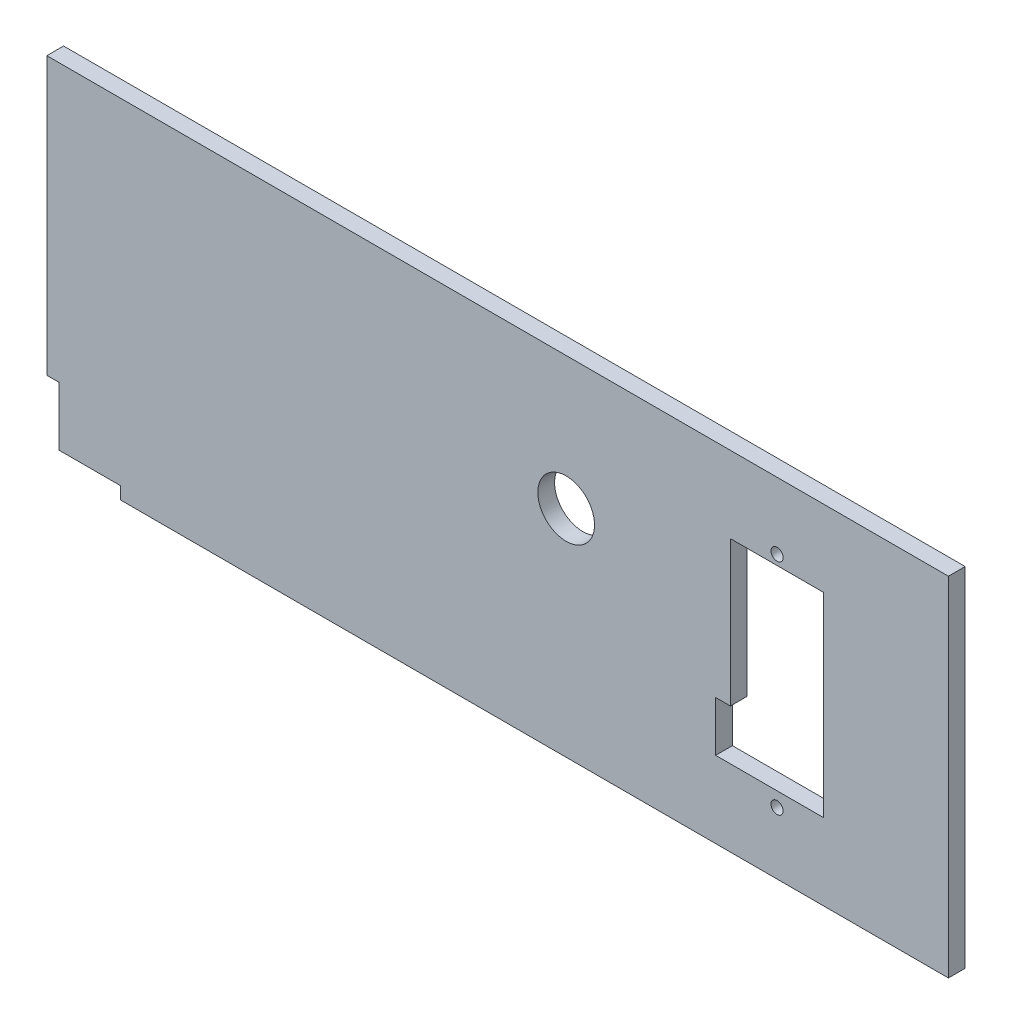
ISO-10303-21;
HEADER;
FILE_DESCRIPTION(('STEP AP214'),'2;1');
FILE_NAME('part.step','',(''),(''),'','','');
FILE_SCHEMA(('AUTOMOTIVE_DESIGN { 1 0 10303 214 1 1 1 1 }'));
ENDSEC;
DATA;
#1=APPLICATION_CONTEXT('core data for automotive mechanical design processes');
#2=APPLICATION_PROTOCOL_DEFINITION('international standard','automotive_design',2000,#1);
#3=PRODUCT_CONTEXT('',#1,'mechanical');
#4=PRODUCT('Part','Part','',(#3));
#5=PRODUCT_RELATED_PRODUCT_CATEGORY('part','',(#4));
#6=PRODUCT_DEFINITION_FORMATION('','',#4);
#7=PRODUCT_DEFINITION_CONTEXT('part definition',#1,'design');
#8=PRODUCT_DEFINITION('design','',#6,#7);
#9=PRODUCT_DEFINITION_SHAPE('','',#8);
#10=(LENGTH_UNIT() NAMED_UNIT(*) SI_UNIT(.MILLI.,.METRE.));
#11=(NAMED_UNIT(*) PLANE_ANGLE_UNIT() SI_UNIT($,.RADIAN.));
#12=(NAMED_UNIT(*) SI_UNIT($,.STERADIAN.) SOLID_ANGLE_UNIT());
#13=UNCERTAINTY_MEASURE_WITH_UNIT(LENGTH_MEASURE(1.E-05),#10,'distance_accuracy_value','');
#14=(GEOMETRIC_REPRESENTATION_CONTEXT(3) GLOBAL_UNCERTAINTY_ASSIGNED_CONTEXT((#13)) GLOBAL_UNIT_ASSIGNED_CONTEXT((#10,
#11,#12)) REPRESENTATION_CONTEXT('',''));
#15=CARTESIAN_POINT('',(0.,0.,0.));
#16=DIRECTION('',(0.,0.,1.));
#17=DIRECTION('',(1.,0.,0.));
#18=AXIS2_PLACEMENT_3D('',#15,#16,#17);
#19=CARTESIAN_POINT('',(0.,0.,6.35));
#20=DIRECTION('',(0.,0.,-1.));
#21=DIRECTION('',(-1.,0.,0.));
#22=AXIS2_PLACEMENT_3D('',#19,#20,#21);
#23=PLANE('',#22);
#24=DIRECTION('',(0.,1.,0.));
#25=VECTOR('',#24,1.);
#26=CARTESIAN_POINT('',(341.,6.00000000000009,6.35));
#27=LINE('',#26,#25);
#28=CARTESIAN_POINT('',(341.,6.00000000000009,6.35));
#29=VERTEX_POINT('',#28);
#30=CARTESIAN_POINT('',(341.,138.,6.35));
#31=VERTEX_POINT('',#30);
#32=EDGE_CURVE('E188',#29,#31,#27,.T.);
#33=ORIENTED_EDGE('',*,*,#32,.T.);
#34=DIRECTION('',(-1.,0.,0.));
#35=VECTOR('',#34,1.);
#36=CARTESIAN_POINT('',(-1.00000000000002,138.,6.35));
#37=LINE('',#36,#35);
#38=CARTESIAN_POINT('',(-1.00000000000002,138.,6.35));
#39=VERTEX_POINT('',#38);
#40=EDGE_CURVE('E191',#31,#39,#37,.T.);
#41=ORIENTED_EDGE('',*,*,#40,.T.);
#42=DIRECTION('',(0.,-1.,0.));
#43=VECTOR('',#42,1.);
#44=CARTESIAN_POINT('',(-1.00000000000002,138.,6.35));
#45=LINE('',#44,#43);
#46=CARTESIAN_POINT('',(-1.00000000000001,33.,6.35));
#47=VERTEX_POINT('',#46);
#48=EDGE_CURVE('E194',#39,#47,#45,.T.);
#49=ORIENTED_EDGE('',*,*,#48,.T.);
#50=DIRECTION('',(1.,0.,0.));
#51=VECTOR('',#50,1.);
#52=CARTESIAN_POINT('',(3.69999999999999,33.,6.35));
#53=LINE('',#52,#51);
#54=CARTESIAN_POINT('',(3.69999999999999,33.,6.35));
#55=VERTEX_POINT('',#54);
#56=EDGE_CURVE('E196',#47,#55,#53,.T.);
#57=ORIENTED_EDGE('',*,*,#56,.T.);
#58=DIRECTION('',(0.,-1.,0.));
#59=VECTOR('',#58,1.);
#60=CARTESIAN_POINT('',(3.69999999999999,10.7,6.35));
#61=LINE('',#60,#59);
#62=CARTESIAN_POINT('',(3.69999999999999,10.7,6.35));
#63=VERTEX_POINT('',#62);
#64=EDGE_CURVE('E198',#55,#63,#61,.T.);
#65=ORIENTED_EDGE('',*,*,#64,.T.);
#66=DIRECTION('',(1.,0.,0.));
#67=VECTOR('',#66,1.);
#68=CARTESIAN_POINT('',(27.,10.7,6.35));
#69=LINE('',#68,#67);
#70=CARTESIAN_POINT('',(27.,10.7,6.35));
#71=VERTEX_POINT('',#70);
#72=EDGE_CURVE('E200',#63,#71,#69,.T.);
#73=ORIENTED_EDGE('',*,*,#72,.T.);
#74=DIRECTION('',(0.,-1.,0.));
#75=VECTOR('',#74,1.);
#76=CARTESIAN_POINT('',(27.,10.7,6.35));
#77=LINE('',#76,#75);
#78=CARTESIAN_POINT('',(27.,5.99999999999999,6.35));
#79=VERTEX_POINT('',#78);
#80=EDGE_CURVE('E202',#71,#79,#77,.T.);
#81=ORIENTED_EDGE('',*,*,#80,.T.);
#82=DIRECTION('',(1.,0.,0.));
#83=VECTOR('',#82,1.);
#84=CARTESIAN_POINT('',(27.,5.99999999999999,6.35));
#85=LINE('',#84,#83);
#86=EDGE_CURVE('E204',#79,#29,#85,.T.);
#87=ORIENTED_EDGE('',*,*,#86,.T.);
#88=EDGE_LOOP('',(#33,#41,#49,#57,#65,#73,#81,#87));
#89=FACE_BOUND('',#88,.T.);
#90=DIRECTION('',(0.,-1.,0.));
#91=VECTOR('',#90,1.);
#92=CARTESIAN_POINT('',(252.7,54.,6.35));
#93=LINE('',#92,#91);
#94=CARTESIAN_POINT('',(252.7,54.,6.35));
#95=VERTEX_POINT('',#94);
#96=CARTESIAN_POINT('',(252.7,35.,6.35));
#97=VERTEX_POINT('',#96);
#98=EDGE_CURVE('E134',#95,#97,#93,.T.);
#99=ORIENTED_EDGE('',*,*,#98,.F.);
#100=DIRECTION('',(-1.,0.,0.));
#101=VECTOR('',#100,1.);
#102=CARTESIAN_POINT('',(258.3,54.0000000000001,6.35));
#103=LINE('',#102,#101);
#104=CARTESIAN_POINT('',(258.3,54.0000000000001,6.35));
#105=VERTEX_POINT('',#104);
#106=EDGE_CURVE('E165',#105,#95,#103,.T.);
#107=ORIENTED_EDGE('',*,*,#106,.F.);
#108=DIRECTION('',(0.,-1.,0.));
#109=VECTOR('',#108,1.);
#110=CARTESIAN_POINT('',(258.3,109.,6.35));
#111=LINE('',#110,#109);
#112=CARTESIAN_POINT('',(258.3,109.,6.35));
#113=VERTEX_POINT('',#112);
#114=EDGE_CURVE('E163',#113,#105,#111,.T.);
#115=ORIENTED_EDGE('',*,*,#114,.F.);
#116=DIRECTION('',(-1.,0.,0.));
#117=VECTOR('',#116,1.);
#118=CARTESIAN_POINT('',(293.7,109.,6.35));
#119=LINE('',#118,#117);
#120=CARTESIAN_POINT('',(293.7,109.,6.35));
#121=VERTEX_POINT('',#120);
#122=EDGE_CURVE('E158',#121,#113,#119,.T.);
#123=ORIENTED_EDGE('',*,*,#122,.F.);
#124=DIRECTION('',(0.,1.,0.));
#125=VECTOR('',#124,1.);
#126=CARTESIAN_POINT('',(293.7,35.0000000000001,6.35));
#127=LINE('',#126,#125);
#128=CARTESIAN_POINT('',(293.7,35.0000000000001,6.35));
#129=VERTEX_POINT('',#128);
#130=EDGE_CURVE('E156',#129,#121,#127,.T.);
#131=ORIENTED_EDGE('',*,*,#130,.F.);
#132=DIRECTION('',(1.,0.,0.));
#133=VECTOR('',#132,1.);
#134=CARTESIAN_POINT('',(293.7,35.0000000000001,6.35));
#135=LINE('',#134,#133);
#136=EDGE_CURVE('E142',#97,#129,#135,.T.);
#137=ORIENTED_EDGE('',*,*,#136,.F.);
#138=EDGE_LOOP('',(#99,#107,#115,#123,#131,#137));
#139=FACE_BOUND('',#138,.T.);
#140=CARTESIAN_POINT('',(276.,112.7,6.35));
#141=DIRECTION('',(0.,0.,1.));
#142=DIRECTION('',(1.,0.,0.));
#143=AXIS2_PLACEMENT_3D('',#140,#141,#142);
#144=CIRCLE('',#143,2.30000000000004);
#145=CARTESIAN_POINT('',(278.3,112.7,6.35));
#146=VERTEX_POINT('',#145);
#147=EDGE_CURVE('E168',#146,#146,#144,.T.);
#148=ORIENTED_EDGE('',*,*,#147,.F.);
#149=EDGE_LOOP('',(#148));
#150=FACE_BOUND('',#149,.T.);
#151=CARTESIAN_POINT('',(276.,29.5,6.35));
#152=DIRECTION('',(0.,0.,1.));
#153=DIRECTION('',(1.,0.,0.));
#154=AXIS2_PLACEMENT_3D('',#151,#152,#153);
#155=CIRCLE('',#154,2.30000000000003);
#156=CARTESIAN_POINT('',(278.3,29.5,6.35));
#157=VERTEX_POINT('',#156);
#158=EDGE_CURVE('E348',#157,#157,#155,.T.);
#159=ORIENTED_EDGE('',*,*,#158,.F.);
#160=EDGE_LOOP('',(#159));
#161=FACE_BOUND('',#160,.T.);
#162=CARTESIAN_POINT('',(196.,87.7,6.35));
#163=DIRECTION('',(0.,0.,1.));
#164=DIRECTION('',(1.,0.,0.));
#165=AXIS2_PLACEMENT_3D('',#162,#163,#164);
#166=CIRCLE('',#165,10.75);
#167=CARTESIAN_POINT('',(206.75,87.7,6.35));
#168=VERTEX_POINT('',#167);
#169=EDGE_CURVE('E339',#168,#168,#166,.T.);
#170=ORIENTED_EDGE('',*,*,#169,.F.);
#171=EDGE_LOOP('',(#170));
#172=FACE_BOUND('',#171,.T.);
#173=ADVANCED_FACE('F33',(#89,#139,#150,#161,#172),#23,.F.);
#174=CARTESIAN_POINT('',(0.,0.,0.));
#175=DIRECTION('',(0.,0.,-1.));
#176=DIRECTION('',(-1.,0.,0.));
#177=AXIS2_PLACEMENT_3D('',#174,#175,#176);
#178=PLANE('',#177);
#179=CARTESIAN_POINT('',(276.,29.5,0.));
#180=DIRECTION('',(0.,0.,1.));
#181=DIRECTION('',(1.,0.,0.));
#182=AXIS2_PLACEMENT_3D('',#179,#180,#181);
#183=CIRCLE('',#182,2.30000000000003);
#184=CARTESIAN_POINT('',(278.3,29.5,0.));
#185=VERTEX_POINT('',#184);
#186=EDGE_CURVE('E345',#185,#185,#183,.T.);
#187=ORIENTED_EDGE('',*,*,#186,.T.);
#188=EDGE_LOOP('',(#187));
#189=FACE_BOUND('',#188,.T.);
#190=DIRECTION('',(-1.,0.,0.));
#191=VECTOR('',#190,1.);
#192=CARTESIAN_POINT('',(258.3,54.0000000000001,0.));
#193=LINE('',#192,#191);
#194=CARTESIAN_POINT('',(258.3,54.0000000000001,0.));
#195=VERTEX_POINT('',#194);
#196=CARTESIAN_POINT('',(252.7,54.,0.));
#197=VERTEX_POINT('',#196);
#198=EDGE_CURVE('E143',#195,#197,#193,.T.);
#199=ORIENTED_EDGE('',*,*,#198,.T.);
#200=DIRECTION('',(0.,-1.,0.));
#201=VECTOR('',#200,1.);
#202=CARTESIAN_POINT('',(252.7,54.,0.));
#203=LINE('',#202,#201);
#204=CARTESIAN_POINT('',(252.7,35.,0.));
#205=VERTEX_POINT('',#204);
#206=EDGE_CURVE('E56',#197,#205,#203,.T.);
#207=ORIENTED_EDGE('',*,*,#206,.T.);
#208=DIRECTION('',(1.,0.,0.));
#209=VECTOR('',#208,1.);
#210=CARTESIAN_POINT('',(293.7,35.0000000000001,0.));
#211=LINE('',#210,#209);
#212=CARTESIAN_POINT('',(293.7,35.0000000000001,0.));
#213=VERTEX_POINT('',#212);
#214=EDGE_CURVE('E149',#205,#213,#211,.T.);
#215=ORIENTED_EDGE('',*,*,#214,.T.);
#216=DIRECTION('',(0.,1.,0.));
#217=VECTOR('',#216,1.);
#218=CARTESIAN_POINT('',(293.7,35.0000000000001,0.));
#219=LINE('',#218,#217);
#220=CARTESIAN_POINT('',(293.7,109.,0.));
#221=VERTEX_POINT('',#220);
#222=EDGE_CURVE('E170',#213,#221,#219,.T.);
#223=ORIENTED_EDGE('',*,*,#222,.T.);
#224=DIRECTION('',(-1.,0.,0.));
#225=VECTOR('',#224,1.);
#226=CARTESIAN_POINT('',(293.7,109.,0.));
#227=LINE('',#226,#225);
#228=CARTESIAN_POINT('',(258.3,109.,0.));
#229=VERTEX_POINT('',#228);
#230=EDGE_CURVE('E173',#221,#229,#227,.T.);
#231=ORIENTED_EDGE('',*,*,#230,.T.);
#232=DIRECTION('',(0.,-1.,0.));
#233=VECTOR('',#232,1.);
#234=CARTESIAN_POINT('',(258.3,109.,0.));
#235=LINE('',#234,#233);
#236=EDGE_CURVE('E176',#229,#195,#235,.T.);
#237=ORIENTED_EDGE('',*,*,#236,.T.);
#238=EDGE_LOOP('',(#199,#207,#215,#223,#231,#237));
#239=FACE_BOUND('',#238,.T.);
#240=DIRECTION('',(0.,1.,0.));
#241=VECTOR('',#240,1.);
#242=CARTESIAN_POINT('',(341.,6.00000000000009,0.));
#243=LINE('',#242,#241);
#244=CARTESIAN_POINT('',(341.,6.00000000000009,0.));
#245=VERTEX_POINT('',#244);
#246=CARTESIAN_POINT('',(341.,138.,0.));
#247=VERTEX_POINT('',#246);
#248=EDGE_CURVE('E150',#245,#247,#243,.T.);
#249=ORIENTED_EDGE('',*,*,#248,.F.);
#250=DIRECTION('',(1.,0.,0.));
#251=VECTOR('',#250,1.);
#252=CARTESIAN_POINT('',(27.,5.99999999999999,0.));
#253=LINE('',#252,#251);
#254=CARTESIAN_POINT('',(27.,5.99999999999999,0.));
#255=VERTEX_POINT('',#254);
#256=EDGE_CURVE('E192',#255,#245,#253,.T.);
#257=ORIENTED_EDGE('',*,*,#256,.F.);
#258=DIRECTION('',(0.,-1.,0.));
#259=VECTOR('',#258,1.);
#260=CARTESIAN_POINT('',(27.,10.7,0.));
#261=LINE('',#260,#259);
#262=CARTESIAN_POINT('',(27.,10.7,0.));
#263=VERTEX_POINT('',#262);
#264=EDGE_CURVE('E219',#263,#255,#261,.T.);
#265=ORIENTED_EDGE('',*,*,#264,.F.);
#266=DIRECTION('',(1.,0.,0.));
#267=VECTOR('',#266,1.);
#268=CARTESIAN_POINT('',(27.,10.7,0.));
#269=LINE('',#268,#267);
#270=CARTESIAN_POINT('',(3.69999999999999,10.7,0.));
#271=VERTEX_POINT('',#270);
#272=EDGE_CURVE('E217',#271,#263,#269,.T.);
#273=ORIENTED_EDGE('',*,*,#272,.F.);
#274=DIRECTION('',(0.,-1.,0.));
#275=VECTOR('',#274,1.);
#276=CARTESIAN_POINT('',(3.69999999999999,10.7,0.));
#277=LINE('',#276,#275);
#278=CARTESIAN_POINT('',(3.69999999999999,33.,0.));
#279=VERTEX_POINT('',#278);
#280=EDGE_CURVE('E215',#279,#271,#277,.T.);
#281=ORIENTED_EDGE('',*,*,#280,.F.);
#282=DIRECTION('',(1.,0.,0.));
#283=VECTOR('',#282,1.);
#284=CARTESIAN_POINT('',(3.69999999999999,33.,0.));
#285=LINE('',#284,#283);
#286=CARTESIAN_POINT('',(-1.00000000000001,33.,0.));
#287=VERTEX_POINT('',#286);
#288=EDGE_CURVE('E213',#287,#279,#285,.T.);
#289=ORIENTED_EDGE('',*,*,#288,.F.);
#290=DIRECTION('',(0.,-1.,0.));
#291=VECTOR('',#290,1.);
#292=CARTESIAN_POINT('',(-1.00000000000002,138.,0.));
#293=LINE('',#292,#291);
#294=CARTESIAN_POINT('',(-1.00000000000002,138.,0.));
#295=VERTEX_POINT('',#294);
#296=EDGE_CURVE('E211',#295,#287,#293,.T.);
#297=ORIENTED_EDGE('',*,*,#296,.F.);
#298=DIRECTION('',(-1.,0.,0.));
#299=VECTOR('',#298,1.);
#300=CARTESIAN_POINT('',(-1.00000000000002,138.,0.));
#301=LINE('',#300,#299);
#302=EDGE_CURVE('E209',#247,#295,#301,.T.);
#303=ORIENTED_EDGE('',*,*,#302,.F.);
#304=EDGE_LOOP('',(#249,#257,#265,#273,#281,#289,#297,#303));
#305=FACE_BOUND('',#304,.T.);
#306=CARTESIAN_POINT('',(276.,112.7,0.));
#307=DIRECTION('',(0.,0.,1.));
#308=DIRECTION('',(1.,0.,0.));
#309=AXIS2_PLACEMENT_3D('',#306,#307,#308);
#310=CIRCLE('',#309,2.30000000000004);
#311=CARTESIAN_POINT('',(278.3,112.7,0.));
#312=VERTEX_POINT('',#311);
#313=EDGE_CURVE('E351',#312,#312,#310,.T.);
#314=ORIENTED_EDGE('',*,*,#313,.T.);
#315=EDGE_LOOP('',(#314));
#316=FACE_BOUND('',#315,.T.);
#317=CARTESIAN_POINT('',(196.,87.7,0.));
#318=DIRECTION('',(0.,0.,1.));
#319=DIRECTION('',(1.,0.,0.));
#320=AXIS2_PLACEMENT_3D('',#317,#318,#319);
#321=CIRCLE('',#320,10.75);
#322=CARTESIAN_POINT('',(206.75,87.7,0.));
#323=VERTEX_POINT('',#322);
#324=EDGE_CURVE('E342',#323,#323,#321,.T.);
#325=ORIENTED_EDGE('',*,*,#324,.T.);
#326=EDGE_LOOP('',(#325));
#327=FACE_BOUND('',#326,.T.);
#328=ADVANCED_FACE('F249',(#189,#239,#305,#316,#327),#178,.T.);
#329=CARTESIAN_POINT('',(341.,6.00000000000009,6.35));
#330=DIRECTION('',(-1.,0.,0.));
#331=DIRECTION('',(0.,0.,1.));
#332=AXIS2_PLACEMENT_3D('',#329,#330,#331);
#333=PLANE('',#332);
#334=ORIENTED_EDGE('',*,*,#248,.T.);
#335=DIRECTION('',(0.,0.,-1.));
#336=VECTOR('',#335,1.);
#337=CARTESIAN_POINT('',(341.,138.,6.35));
#338=LINE('',#337,#336);
#339=EDGE_CURVE('E11',#31,#247,#338,.T.);
#340=ORIENTED_EDGE('',*,*,#339,.F.);
#341=ORIENTED_EDGE('',*,*,#32,.F.);
#342=DIRECTION('',(0.,0.,-1.));
#343=VECTOR('',#342,1.);
#344=CARTESIAN_POINT('',(341.,6.00000000000009,6.35));
#345=LINE('',#344,#343);
#346=EDGE_CURVE('E206',#29,#245,#345,.T.);
#347=ORIENTED_EDGE('',*,*,#346,.T.);
#348=EDGE_LOOP('',(#334,#340,#341,#347));
#349=FACE_BOUND('',#348,.T.);
#350=ADVANCED_FACE('F35',(#349),#333,.F.);
#351=CARTESIAN_POINT('',(-1.00000000000002,138.,6.35));
#352=DIRECTION('',(0.,-1.,0.));
#353=DIRECTION('',(0.,0.,-1.));
#354=AXIS2_PLACEMENT_3D('',#351,#352,#353);
#355=PLANE('',#354);
#356=ORIENTED_EDGE('',*,*,#302,.T.);
#357=DIRECTION('',(0.,0.,-1.));
#358=VECTOR('',#357,1.);
#359=CARTESIAN_POINT('',(-1.00000000000002,138.,6.35));
#360=LINE('',#359,#358);
#361=EDGE_CURVE('E41',#39,#295,#360,.T.);
#362=ORIENTED_EDGE('',*,*,#361,.F.);
#363=ORIENTED_EDGE('',*,*,#40,.F.);
#364=ORIENTED_EDGE('',*,*,#339,.T.);
#365=EDGE_LOOP('',(#356,#362,#363,#364));
#366=FACE_BOUND('',#365,.T.);
#367=ADVANCED_FACE('F266',(#366),#355,.F.);
#368=CARTESIAN_POINT('',(-1.00000000000002,138.,6.35));
#369=DIRECTION('',(1.,0.,0.));
#370=DIRECTION('',(0.,1.,0.));
#371=AXIS2_PLACEMENT_3D('',#368,#369,#370);
#372=PLANE('',#371);
#373=ORIENTED_EDGE('',*,*,#296,.T.);
#374=DIRECTION('',(0.,0.,-1.));
#375=VECTOR('',#374,1.);
#376=CARTESIAN_POINT('',(-1.00000000000001,33.,6.35));
#377=LINE('',#376,#375);
#378=EDGE_CURVE('E236',#47,#287,#377,.T.);
#379=ORIENTED_EDGE('',*,*,#378,.F.);
#380=ORIENTED_EDGE('',*,*,#48,.F.);
#381=ORIENTED_EDGE('',*,*,#361,.T.);
#382=EDGE_LOOP('',(#373,#379,#380,#381));
#383=FACE_BOUND('',#382,.T.);
#384=ADVANCED_FACE('F243',(#383),#372,.F.);
#385=CARTESIAN_POINT('',(3.69999999999999,33.,6.35));
#386=DIRECTION('',(0.,1.,0.));
#387=DIRECTION('',(0.,0.,1.));
#388=AXIS2_PLACEMENT_3D('',#385,#386,#387);
#389=PLANE('',#388);
#390=ORIENTED_EDGE('',*,*,#288,.T.);
#391=DIRECTION('',(0.,0.,-1.));
#392=VECTOR('',#391,1.);
#393=CARTESIAN_POINT('',(3.69999999999999,33.,6.35));
#394=LINE('',#393,#392);
#395=EDGE_CURVE('E233',#55,#279,#394,.T.);
#396=ORIENTED_EDGE('',*,*,#395,.F.);
#397=ORIENTED_EDGE('',*,*,#56,.F.);
#398=ORIENTED_EDGE('',*,*,#378,.T.);
#399=EDGE_LOOP('',(#390,#396,#397,#398));
#400=FACE_BOUND('',#399,.T.);
#401=ADVANCED_FACE('F255',(#400),#389,.F.);
#402=CARTESIAN_POINT('',(3.69999999999999,10.7,6.35));
#403=DIRECTION('',(1.,0.,0.));
#404=DIRECTION('',(0.,0.,-1.));
#405=AXIS2_PLACEMENT_3D('',#402,#403,#404);
#406=PLANE('',#405);
#407=ORIENTED_EDGE('',*,*,#280,.T.);
#408=DIRECTION('',(0.,0.,-1.));
#409=VECTOR('',#408,1.);
#410=CARTESIAN_POINT('',(3.69999999999999,10.7,6.35));
#411=LINE('',#410,#409);
#412=EDGE_CURVE('E230',#63,#271,#411,.T.);
#413=ORIENTED_EDGE('',*,*,#412,.F.);
#414=ORIENTED_EDGE('',*,*,#64,.F.);
#415=ORIENTED_EDGE('',*,*,#395,.T.);
#416=EDGE_LOOP('',(#407,#413,#414,#415));
#417=FACE_BOUND('',#416,.T.);
#418=ADVANCED_FACE('F259',(#417),#406,.F.);
#419=CARTESIAN_POINT('',(27.,10.7,6.35));
#420=DIRECTION('',(0.,1.,0.));
#421=DIRECTION('',(-1.,0.,0.));
#422=AXIS2_PLACEMENT_3D('',#419,#420,#421);
#423=PLANE('',#422);
#424=ORIENTED_EDGE('',*,*,#272,.T.);
#425=DIRECTION('',(0.,0.,-1.));
#426=VECTOR('',#425,1.);
#427=CARTESIAN_POINT('',(27.,10.7,6.35));
#428=LINE('',#427,#426);
#429=EDGE_CURVE('E227',#71,#263,#428,.T.);
#430=ORIENTED_EDGE('',*,*,#429,.F.);
#431=ORIENTED_EDGE('',*,*,#72,.F.);
#432=ORIENTED_EDGE('',*,*,#412,.T.);
#433=EDGE_LOOP('',(#424,#430,#431,#432));
#434=FACE_BOUND('',#433,.T.);
#435=ADVANCED_FACE('F279',(#434),#423,.F.);
#436=CARTESIAN_POINT('',(27.,10.7,6.35));
#437=DIRECTION('',(1.,0.,0.));
#438=DIRECTION('',(0.,0.,-1.));
#439=AXIS2_PLACEMENT_3D('',#436,#437,#438);
#440=PLANE('',#439);
#441=ORIENTED_EDGE('',*,*,#264,.T.);
#442=DIRECTION('',(0.,0.,-1.));
#443=VECTOR('',#442,1.);
#444=CARTESIAN_POINT('',(27.,5.99999999999999,6.35));
#445=LINE('',#444,#443);
#446=EDGE_CURVE('E224',#79,#255,#445,.T.);
#447=ORIENTED_EDGE('',*,*,#446,.F.);
#448=ORIENTED_EDGE('',*,*,#80,.F.);
#449=ORIENTED_EDGE('',*,*,#429,.T.);
#450=EDGE_LOOP('',(#441,#447,#448,#449));
#451=FACE_BOUND('',#450,.T.);
#452=ADVANCED_FACE('F277',(#451),#440,.F.);
#453=CARTESIAN_POINT('',(27.,5.99999999999999,6.35));
#454=DIRECTION('',(0.,1.,0.));
#455=DIRECTION('',(-1.,0.,0.));
#456=AXIS2_PLACEMENT_3D('',#453,#454,#455);
#457=PLANE('',#456);
#458=ORIENTED_EDGE('',*,*,#256,.T.);
#459=ORIENTED_EDGE('',*,*,#346,.F.);
#460=ORIENTED_EDGE('',*,*,#86,.F.);
#461=ORIENTED_EDGE('',*,*,#446,.T.);
#462=EDGE_LOOP('',(#458,#459,#460,#461));
#463=FACE_BOUND('',#462,.T.);
#464=ADVANCED_FACE('F272',(#463),#457,.F.);
#465=CARTESIAN_POINT('',(252.7,54.,6.35));
#466=DIRECTION('',(1.,0.,0.));
#467=DIRECTION('',(0.,0.,-1.));
#468=AXIS2_PLACEMENT_3D('',#465,#466,#467);
#469=PLANE('',#468);
#470=ORIENTED_EDGE('',*,*,#206,.F.);
#471=DIRECTION('',(0.,0.,-1.));
#472=VECTOR('',#471,1.);
#473=CARTESIAN_POINT('',(252.7,54.,6.35));
#474=LINE('',#473,#472);
#475=EDGE_CURVE('E138',#95,#197,#474,.T.);
#476=ORIENTED_EDGE('',*,*,#475,.F.);
#477=ORIENTED_EDGE('',*,*,#98,.T.);
#478=DIRECTION('',(0.,0.,-1.));
#479=VECTOR('',#478,1.);
#480=CARTESIAN_POINT('',(252.7,35.,6.35));
#481=LINE('',#480,#479);
#482=EDGE_CURVE('E137',#97,#205,#481,.T.);
#483=ORIENTED_EDGE('',*,*,#482,.T.);
#484=EDGE_LOOP('',(#470,#476,#477,#483));
#485=FACE_BOUND('',#484,.T.);
#486=ADVANCED_FACE('F136',(#485),#469,.T.);
#487=CARTESIAN_POINT('',(293.7,35.0000000000001,6.35));
#488=DIRECTION('',(0.,1.,0.));
#489=DIRECTION('',(-1.,0.,0.));
#490=AXIS2_PLACEMENT_3D('',#487,#488,#489);
#491=PLANE('',#490);
#492=ORIENTED_EDGE('',*,*,#214,.F.);
#493=ORIENTED_EDGE('',*,*,#482,.F.);
#494=ORIENTED_EDGE('',*,*,#136,.T.);
#495=DIRECTION('',(0.,0.,-1.));
#496=VECTOR('',#495,1.);
#497=CARTESIAN_POINT('',(293.7,35.0000000000001,6.35));
#498=LINE('',#497,#496);
#499=EDGE_CURVE('E151',#129,#213,#498,.T.);
#500=ORIENTED_EDGE('',*,*,#499,.T.);
#501=EDGE_LOOP('',(#492,#493,#494,#500));
#502=FACE_BOUND('',#501,.T.);
#503=ADVANCED_FACE('F146',(#502),#491,.T.);
#504=CARTESIAN_POINT('',(293.7,35.0000000000001,6.35));
#505=DIRECTION('',(-1.,0.,0.));
#506=DIRECTION('',(0.,0.,1.));
#507=AXIS2_PLACEMENT_3D('',#504,#505,#506);
#508=PLANE('',#507);
#509=ORIENTED_EDGE('',*,*,#222,.F.);
#510=ORIENTED_EDGE('',*,*,#499,.F.);
#511=ORIENTED_EDGE('',*,*,#130,.T.);
#512=DIRECTION('',(0.,0.,-1.));
#513=VECTOR('',#512,1.);
#514=CARTESIAN_POINT('',(293.7,109.,6.35));
#515=LINE('',#514,#513);
#516=EDGE_CURVE('E185',#121,#221,#515,.T.);
#517=ORIENTED_EDGE('',*,*,#516,.T.);
#518=EDGE_LOOP('',(#509,#510,#511,#517));
#519=FACE_BOUND('',#518,.T.);
#520=ADVANCED_FACE('F305',(#519),#508,.T.);
#521=CARTESIAN_POINT('',(293.7,109.,6.35));
#522=DIRECTION('',(0.,-1.,0.));
#523=DIRECTION('',(0.,0.,-1.));
#524=AXIS2_PLACEMENT_3D('',#521,#522,#523);
#525=PLANE('',#524);
#526=ORIENTED_EDGE('',*,*,#230,.F.);
#527=ORIENTED_EDGE('',*,*,#516,.F.);
#528=ORIENTED_EDGE('',*,*,#122,.T.);
#529=DIRECTION('',(0.,0.,-1.));
#530=VECTOR('',#529,1.);
#531=CARTESIAN_POINT('',(258.3,109.,6.35));
#532=LINE('',#531,#530);
#533=EDGE_CURVE('E183',#113,#229,#532,.T.);
#534=ORIENTED_EDGE('',*,*,#533,.T.);
#535=EDGE_LOOP('',(#526,#527,#528,#534));
#536=FACE_BOUND('',#535,.T.);
#537=ADVANCED_FACE('F309',(#536),#525,.T.);
#538=CARTESIAN_POINT('',(258.3,109.,6.35));
#539=DIRECTION('',(1.,0.,0.));
#540=DIRECTION('',(0.,0.,-1.));
#541=AXIS2_PLACEMENT_3D('',#538,#539,#540);
#542=PLANE('',#541);
#543=ORIENTED_EDGE('',*,*,#236,.F.);
#544=ORIENTED_EDGE('',*,*,#533,.F.);
#545=ORIENTED_EDGE('',*,*,#114,.T.);
#546=DIRECTION('',(0.,0.,-1.));
#547=VECTOR('',#546,1.);
#548=CARTESIAN_POINT('',(258.3,54.0000000000001,6.35));
#549=LINE('',#548,#547);
#550=EDGE_CURVE('E48',#105,#195,#549,.T.);
#551=ORIENTED_EDGE('',*,*,#550,.T.);
#552=EDGE_LOOP('',(#543,#544,#545,#551));
#553=FACE_BOUND('',#552,.T.);
#554=ADVANCED_FACE('F315',(#553),#542,.T.);
#555=CARTESIAN_POINT('',(258.3,54.0000000000001,6.35));
#556=DIRECTION('',(0.,-1.,0.));
#557=DIRECTION('',(1.,0.,0.));
#558=AXIS2_PLACEMENT_3D('',#555,#556,#557);
#559=PLANE('',#558);
#560=ORIENTED_EDGE('',*,*,#198,.F.);
#561=ORIENTED_EDGE('',*,*,#550,.F.);
#562=ORIENTED_EDGE('',*,*,#106,.T.);
#563=ORIENTED_EDGE('',*,*,#475,.T.);
#564=EDGE_LOOP('',(#560,#561,#562,#563));
#565=FACE_BOUND('',#564,.T.);
#566=ADVANCED_FACE('F319',(#565),#559,.T.);
#567=CARTESIAN_POINT('',(276.,112.7,6.35));
#568=DIRECTION('',(0.,0.,-1.));
#569=DIRECTION('',(-1.,0.,0.));
#570=AXIS2_PLACEMENT_3D('',#567,#568,#569);
#571=CYLINDRICAL_SURFACE('',#570,2.30000000000004);
#572=ORIENTED_EDGE('',*,*,#147,.T.);
#573=EDGE_LOOP('',(#572));
#574=FACE_BOUND('',#573,.T.);
#575=ORIENTED_EDGE('',*,*,#313,.F.);
#576=EDGE_LOOP('',(#575));
#577=FACE_BOUND('',#576,.T.);
#578=ADVANCED_FACE('F323',(#574,#577),#571,.F.);
#579=CARTESIAN_POINT('',(276.,29.5,6.35));
#580=DIRECTION('',(0.,0.,-1.));
#581=DIRECTION('',(-1.,0.,0.));
#582=AXIS2_PLACEMENT_3D('',#579,#580,#581);
#583=CYLINDRICAL_SURFACE('',#582,2.30000000000003);
#584=ORIENTED_EDGE('',*,*,#158,.T.);
#585=EDGE_LOOP('',(#584));
#586=FACE_BOUND('',#585,.T.);
#587=ORIENTED_EDGE('',*,*,#186,.F.);
#588=EDGE_LOOP('',(#587));
#589=FACE_BOUND('',#588,.T.);
#590=ADVANCED_FACE('F326',(#586,#589),#583,.F.);
#591=CARTESIAN_POINT('',(196.,87.7,6.35));
#592=DIRECTION('',(0.,0.,-1.));
#593=DIRECTION('',(-1.,0.,0.));
#594=AXIS2_PLACEMENT_3D('',#591,#592,#593);
#595=CYLINDRICAL_SURFACE('',#594,10.75);
#596=ORIENTED_EDGE('',*,*,#169,.T.);
#597=EDGE_LOOP('',(#596));
#598=FACE_BOUND('',#597,.T.);
#599=ORIENTED_EDGE('',*,*,#324,.F.);
#600=EDGE_LOOP('',(#599));
#601=FACE_BOUND('',#600,.T.);
#602=ADVANCED_FACE('F330',(#598,#601),#595,.F.);
#603=CLOSED_SHELL('',(#173,#328,#350,#367,#384,#401,#418,#435,#452,#464,#486,#503,#520,#537,
#554,#566,#578,#590,#602));
#604=MANIFOLD_SOLID_BREP('B2',#603);
#605=ADVANCED_BREP_SHAPE_REPRESENTATION('',(#18,#604),#14);
#606=SHAPE_DEFINITION_REPRESENTATION(#9,#605);
ENDSEC;
END-ISO-10303-21;
